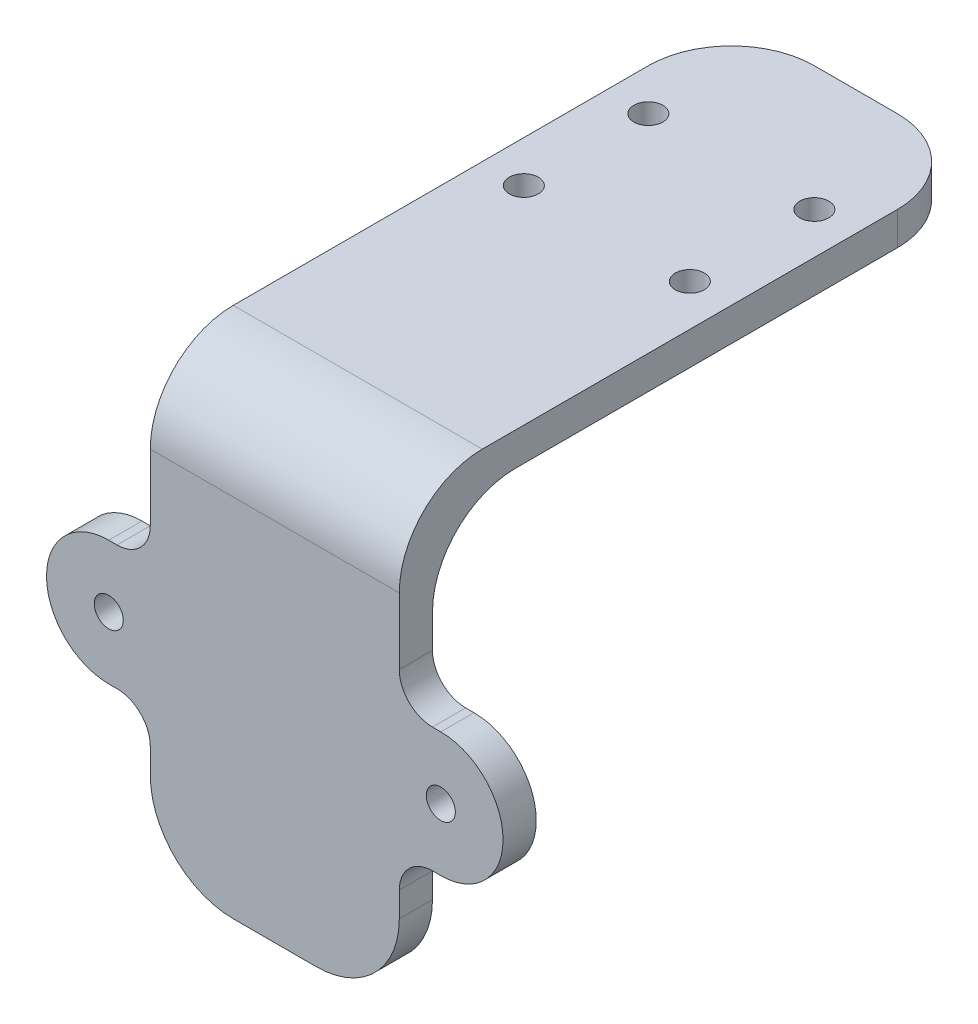
ISO-10303-21;
HEADER;
FILE_DESCRIPTION(('STEP AP214'),'2;1');
FILE_NAME('part.step','',(''),(''),'','','');
FILE_SCHEMA(('AUTOMOTIVE_DESIGN { 1 0 10303 214 1 1 1 1 }'));
ENDSEC;
DATA;
#1=APPLICATION_CONTEXT('core data for automotive mechanical design processes');
#2=APPLICATION_PROTOCOL_DEFINITION('international standard','automotive_design',2000,#1);
#3=PRODUCT_CONTEXT('',#1,'mechanical');
#4=PRODUCT('Part','Part','',(#3));
#5=PRODUCT_RELATED_PRODUCT_CATEGORY('part','',(#4));
#6=PRODUCT_DEFINITION_FORMATION('','',#4);
#7=PRODUCT_DEFINITION_CONTEXT('part definition',#1,'design');
#8=PRODUCT_DEFINITION('design','',#6,#7);
#9=PRODUCT_DEFINITION_SHAPE('','',#8);
#10=(LENGTH_UNIT() NAMED_UNIT(*) SI_UNIT(.MILLI.,.METRE.));
#11=(NAMED_UNIT(*) PLANE_ANGLE_UNIT() SI_UNIT($,.RADIAN.));
#12=(NAMED_UNIT(*) SI_UNIT($,.STERADIAN.) SOLID_ANGLE_UNIT());
#13=UNCERTAINTY_MEASURE_WITH_UNIT(LENGTH_MEASURE(1.E-05),#10,'distance_accuracy_value','');
#14=(GEOMETRIC_REPRESENTATION_CONTEXT(3) GLOBAL_UNCERTAINTY_ASSIGNED_CONTEXT((#13)) GLOBAL_UNIT_ASSIGNED_CONTEXT((#10,
#11,#12)) REPRESENTATION_CONTEXT('',''));
#15=CARTESIAN_POINT('',(0.,0.,0.));
#16=DIRECTION('',(0.,0.,1.));
#17=DIRECTION('',(1.,0.,0.));
#18=AXIS2_PLACEMENT_3D('',#15,#16,#17);
#19=CARTESIAN_POINT('',(10.,-6.94974746830583,-5.));
#20=DIRECTION('',(0.,1.,0.));
#21=DIRECTION('',(0.,0.,1.));
#22=AXIS2_PLACEMENT_3D('',#19,#20,#21);
#23=CYLINDRICAL_SURFACE('',#22,1.75);
#24=CARTESIAN_POINT('',(10.,2.,-5.));
#25=DIRECTION('',(0.,1.,0.));
#26=DIRECTION('',(0.,0.,1.));
#27=AXIS2_PLACEMENT_3D('',#24,#25,#26);
#28=CIRCLE('',#27,1.75);
#29=CARTESIAN_POINT('',(10.,2.,-3.25));
#30=VERTEX_POINT('',#29);
#31=EDGE_CURVE('E315',#30,#30,#28,.T.);
#32=ORIENTED_EDGE('',*,*,#31,.T.);
#33=EDGE_LOOP('',(#32));
#34=FACE_BOUND('',#33,.T.);
#35=CARTESIAN_POINT('',(10.,-2.,-5.));
#36=DIRECTION('',(0.,-1.,0.));
#37=DIRECTION('',(0.,0.,-1.));
#38=AXIS2_PLACEMENT_3D('',#35,#36,#37);
#39=CIRCLE('',#38,1.75);
#40=CARTESIAN_POINT('',(10.,-2.,-6.75000000000001));
#41=VERTEX_POINT('',#40);
#42=EDGE_CURVE('E319',#41,#41,#39,.F.);
#43=ORIENTED_EDGE('',*,*,#42,.F.);
#44=EDGE_LOOP('',(#43));
#45=FACE_BOUND('',#44,.T.);
#46=ADVANCED_FACE('F39',(#34,#45),#23,.F.);
#47=CARTESIAN_POINT('',(10.,-6.94974746830583,-20.));
#48=DIRECTION('',(0.,1.,0.));
#49=DIRECTION('',(0.,0.,1.));
#50=AXIS2_PLACEMENT_3D('',#47,#48,#49);
#51=CYLINDRICAL_SURFACE('',#50,1.75);
#52=CARTESIAN_POINT('',(10.,2.,-20.));
#53=DIRECTION('',(0.,1.,0.));
#54=DIRECTION('',(0.,0.,1.));
#55=AXIS2_PLACEMENT_3D('',#52,#53,#54);
#56=CIRCLE('',#55,1.75);
#57=CARTESIAN_POINT('',(10.,2.,-18.25));
#58=VERTEX_POINT('',#57);
#59=EDGE_CURVE('E307',#58,#58,#56,.T.);
#60=ORIENTED_EDGE('',*,*,#59,.T.);
#61=EDGE_LOOP('',(#60));
#62=FACE_BOUND('',#61,.T.);
#63=CARTESIAN_POINT('',(10.,-2.,-20.));
#64=DIRECTION('',(0.,-1.,0.));
#65=DIRECTION('',(0.,0.,-1.));
#66=AXIS2_PLACEMENT_3D('',#63,#64,#65);
#67=CIRCLE('',#66,1.75);
#68=CARTESIAN_POINT('',(10.,-2.,-21.75));
#69=VERTEX_POINT('',#68);
#70=EDGE_CURVE('E311',#69,#69,#67,.F.);
#71=ORIENTED_EDGE('',*,*,#70,.F.);
#72=EDGE_LOOP('',(#71));
#73=FACE_BOUND('',#72,.T.);
#74=ADVANCED_FACE('F517',(#62,#73),#51,.F.);
#75=CARTESIAN_POINT('',(15.,2.,35.));
#76=DIRECTION('',(-1.,0.,0.));
#77=DIRECTION('',(0.,0.,1.));
#78=AXIS2_PLACEMENT_3D('',#75,#76,#77);
#79=PLANE('',#78);
#80=DIRECTION('',(0.,1.,0.));
#81=VECTOR('',#80,1.);
#82=CARTESIAN_POINT('',(15.,-52.,31.));
#83=LINE('',#82,#81);
#84=CARTESIAN_POINT('',(15.,-42.,31.));
#85=VERTEX_POINT('',#84);
#86=CARTESIAN_POINT('',(15.,-39.,31.));
#87=VERTEX_POINT('',#86);
#88=EDGE_CURVE('E265',#85,#87,#83,.T.);
#89=ORIENTED_EDGE('',*,*,#88,.T.);
#90=DIRECTION('',(0.,0.,1.));
#91=VECTOR('',#90,1.);
#92=CARTESIAN_POINT('',(15.,-39.,35.));
#93=LINE('',#92,#91);
#94=CARTESIAN_POINT('',(15.,-39.,35.));
#95=VERTEX_POINT('',#94);
#96=EDGE_CURVE('E404',#87,#95,#93,.T.);
#97=ORIENTED_EDGE('',*,*,#96,.T.);
#98=DIRECTION('',(0.,-1.,0.));
#99=VECTOR('',#98,1.);
#100=CARTESIAN_POINT('',(15.,2.,35.));
#101=LINE('',#100,#99);
#102=CARTESIAN_POINT('',(15.,-42.,35.));
#103=VERTEX_POINT('',#102);
#104=EDGE_CURVE('E287',#95,#103,#101,.T.);
#105=ORIENTED_EDGE('',*,*,#104,.T.);
#106=DIRECTION('',(0.,0.,1.));
#107=VECTOR('',#106,1.);
#108=CARTESIAN_POINT('',(15.,-42.,35.));
#109=LINE('',#108,#107);
#110=EDGE_CURVE('E394',#103,#85,#109,.F.);
#111=ORIENTED_EDGE('',*,*,#110,.T.);
#112=EDGE_LOOP('',(#89,#97,#105,#111));
#113=FACE_BOUND('',#112,.T.);
#114=ADVANCED_FACE('F546',(#113),#79,.F.);
#115=CARTESIAN_POINT('',(-15.,2.,35.));
#116=DIRECTION('',(1.,0.,0.));
#117=DIRECTION('',(0.,0.,-1.));
#118=AXIS2_PLACEMENT_3D('',#115,#116,#117);
#119=PLANE('',#118);
#120=DIRECTION('',(0.,-1.,0.));
#121=VECTOR('',#120,1.);
#122=CARTESIAN_POINT('',(-15.,2.,35.));
#123=LINE('',#122,#121);
#124=CARTESIAN_POINT('',(-15.,-39.,35.));
#125=VERTEX_POINT('',#124);
#126=CARTESIAN_POINT('',(-15.,-42.,35.));
#127=VERTEX_POINT('',#126);
#128=EDGE_CURVE('E302',#125,#127,#123,.T.);
#129=ORIENTED_EDGE('',*,*,#128,.F.);
#130=DIRECTION('',(0.,0.,-1.));
#131=VECTOR('',#130,1.);
#132=CARTESIAN_POINT('',(-15.,-39.,35.));
#133=LINE('',#132,#131);
#134=CARTESIAN_POINT('',(-15.,-39.,31.));
#135=VERTEX_POINT('',#134);
#136=EDGE_CURVE('E425',#125,#135,#133,.T.);
#137=ORIENTED_EDGE('',*,*,#136,.T.);
#138=DIRECTION('',(0.,1.,0.));
#139=VECTOR('',#138,1.);
#140=CARTESIAN_POINT('',(-15.,-52.,31.));
#141=LINE('',#140,#139);
#142=CARTESIAN_POINT('',(-15.,-42.,31.));
#143=VERTEX_POINT('',#142);
#144=EDGE_CURVE('E270',#143,#135,#141,.T.);
#145=ORIENTED_EDGE('',*,*,#144,.F.);
#146=DIRECTION('',(0.,0.,-1.));
#147=VECTOR('',#146,1.);
#148=CARTESIAN_POINT('',(-15.,-42.,35.));
#149=LINE('',#148,#147);
#150=EDGE_CURVE('E380',#143,#127,#149,.F.);
#151=ORIENTED_EDGE('',*,*,#150,.T.);
#152=EDGE_LOOP('',(#129,#137,#145,#151));
#153=FACE_BOUND('',#152,.T.);
#154=ADVANCED_FACE('F538',(#153),#119,.F.);
#155=CARTESIAN_POINT('',(15.,-8.,35.));
#156=VERTEX_POINT('',#155);
#157=CARTESIAN_POINT('',(15.,-16.,35.));
#158=VERTEX_POINT('',#157);
#159=EDGE_CURVE('E298',#156,#158,#101,.T.);
#160=ORIENTED_EDGE('',*,*,#159,.T.);
#161=DIRECTION('',(0.,0.,-1.));
#162=VECTOR('',#161,1.);
#163=CARTESIAN_POINT('',(15.,-16.,35.));
#164=LINE('',#163,#162);
#165=CARTESIAN_POINT('',(15.,-16.,31.));
#166=VERTEX_POINT('',#165);
#167=EDGE_CURVE('E411',#158,#166,#164,.T.);
#168=ORIENTED_EDGE('',*,*,#167,.T.);
#169=CARTESIAN_POINT('',(15.,-12.,31.));
#170=VERTEX_POINT('',#169);
#171=EDGE_CURVE('E264',#166,#170,#83,.T.);
#172=ORIENTED_EDGE('',*,*,#171,.T.);
#173=CARTESIAN_POINT('',(15.,-12.,21.));
#174=DIRECTION('',(-1.,0.,0.));
#175=DIRECTION('',(0.,0.,1.));
#176=AXIS2_PLACEMENT_3D('',#173,#174,#175);
#177=CIRCLE('',#176,10.);
#178=CARTESIAN_POINT('',(15.,-2.,21.));
#179=VERTEX_POINT('',#178);
#180=EDGE_CURVE('E397',#170,#179,#177,.T.);
#181=ORIENTED_EDGE('',*,*,#180,.T.);
#182=DIRECTION('',(0.,0.,-1.));
#183=VECTOR('',#182,1.);
#184=CARTESIAN_POINT('',(15.,-2.,35.));
#185=LINE('',#184,#183);
#186=CARTESIAN_POINT('',(15.,-2.,-25.));
#187=VERTEX_POINT('',#186);
#188=EDGE_CURVE('E273',#179,#187,#185,.T.);
#189=ORIENTED_EDGE('',*,*,#188,.T.);
#190=DIRECTION('',(0.,-1.,0.));
#191=VECTOR('',#190,1.);
#192=CARTESIAN_POINT('',(15.,2.,-25.));
#193=LINE('',#192,#191);
#194=CARTESIAN_POINT('',(15.,2.,-25.));
#195=VERTEX_POINT('',#194);
#196=EDGE_CURVE('E342',#187,#195,#193,.F.);
#197=ORIENTED_EDGE('',*,*,#196,.T.);
#198=DIRECTION('',(0.,0.,-1.));
#199=VECTOR('',#198,1.);
#200=CARTESIAN_POINT('',(15.,2.,35.));
#201=LINE('',#200,#199);
#202=CARTESIAN_POINT('',(15.,2.,25.));
#203=VERTEX_POINT('',#202);
#204=EDGE_CURVE('E274',#203,#195,#201,.T.);
#205=ORIENTED_EDGE('',*,*,#204,.F.);
#206=CARTESIAN_POINT('',(15.,-8.,25.));
#207=DIRECTION('',(-1.,0.,0.));
#208=DIRECTION('',(0.,0.,1.));
#209=AXIS2_PLACEMENT_3D('',#206,#207,#208);
#210=CIRCLE('',#209,10.);
#211=EDGE_CURVE('E339',#203,#156,#210,.F.);
#212=ORIENTED_EDGE('',*,*,#211,.T.);
#213=EDGE_LOOP('',(#160,#168,#172,#181,#189,#197,#205,#212));
#214=FACE_BOUND('',#213,.T.);
#215=ADVANCED_FACE('F541',(#214),#79,.F.);
#216=CARTESIAN_POINT('',(-15.,2.,-35.));
#217=DIRECTION('',(0.,0.,1.));
#218=DIRECTION('',(1.,0.,0.));
#219=AXIS2_PLACEMENT_3D('',#216,#217,#218);
#220=PLANE('',#219);
#221=DIRECTION('',(-1.,0.,0.));
#222=VECTOR('',#221,1.);
#223=CARTESIAN_POINT('',(-15.,2.,-35.));
#224=LINE('',#223,#222);
#225=CARTESIAN_POINT('',(5.,2.,-35.));
#226=VERTEX_POINT('',#225);
#227=CARTESIAN_POINT('',(-5.,2.,-35.));
#228=VERTEX_POINT('',#227);
#229=EDGE_CURVE('E278',#226,#228,#224,.T.);
#230=ORIENTED_EDGE('',*,*,#229,.F.);
#231=DIRECTION('',(0.,-1.,0.));
#232=VECTOR('',#231,1.);
#233=CARTESIAN_POINT('',(5.,2.,-35.));
#234=LINE('',#233,#232);
#235=CARTESIAN_POINT('',(5.,-2.,-35.));
#236=VERTEX_POINT('',#235);
#237=EDGE_CURVE('E326',#226,#236,#234,.T.);
#238=ORIENTED_EDGE('',*,*,#237,.T.);
#239=DIRECTION('',(-1.,0.,0.));
#240=VECTOR('',#239,1.);
#241=CARTESIAN_POINT('',(-15.,-2.,-35.));
#242=LINE('',#241,#240);
#243=CARTESIAN_POINT('',(-5.,-2.,-35.));
#244=VERTEX_POINT('',#243);
#245=EDGE_CURVE('E291',#236,#244,#242,.T.);
#246=ORIENTED_EDGE('',*,*,#245,.T.);
#247=DIRECTION('',(0.,-1.,0.));
#248=VECTOR('',#247,1.);
#249=CARTESIAN_POINT('',(-5.,2.,-35.));
#250=LINE('',#249,#248);
#251=EDGE_CURVE('E323',#244,#228,#250,.F.);
#252=ORIENTED_EDGE('',*,*,#251,.T.);
#253=EDGE_LOOP('',(#230,#238,#246,#252));
#254=FACE_BOUND('',#253,.T.);
#255=ADVANCED_FACE('F536',(#254),#220,.F.);
#256=CARTESIAN_POINT('',(-15.,-16.,31.));
#257=VERTEX_POINT('',#256);
#258=CARTESIAN_POINT('',(-15.,-12.,31.));
#259=VERTEX_POINT('',#258);
#260=EDGE_CURVE('E269',#257,#259,#141,.T.);
#261=ORIENTED_EDGE('',*,*,#260,.F.);
#262=DIRECTION('',(0.,0.,1.));
#263=VECTOR('',#262,1.);
#264=CARTESIAN_POINT('',(-15.,-16.,35.));
#265=LINE('',#264,#263);
#266=CARTESIAN_POINT('',(-15.,-16.,35.));
#267=VERTEX_POINT('',#266);
#268=EDGE_CURVE('E418',#257,#267,#265,.T.);
#269=ORIENTED_EDGE('',*,*,#268,.T.);
#270=CARTESIAN_POINT('',(-15.,-8.,35.));
#271=VERTEX_POINT('',#270);
#272=EDGE_CURVE('E303',#271,#267,#123,.T.);
#273=ORIENTED_EDGE('',*,*,#272,.F.);
#274=CARTESIAN_POINT('',(-15.,-8.,25.));
#275=DIRECTION('',(1.,0.,0.));
#276=DIRECTION('',(0.,0.,-1.));
#277=AXIS2_PLACEMENT_3D('',#274,#275,#276);
#278=CIRCLE('',#277,10.);
#279=CARTESIAN_POINT('',(-15.,2.,25.));
#280=VERTEX_POINT('',#279);
#281=EDGE_CURVE('E355',#271,#280,#278,.F.);
#282=ORIENTED_EDGE('',*,*,#281,.T.);
#283=DIRECTION('',(0.,0.,1.));
#284=VECTOR('',#283,1.);
#285=CARTESIAN_POINT('',(-15.,2.,35.));
#286=LINE('',#285,#284);
#287=CARTESIAN_POINT('',(-15.,2.,-25.));
#288=VERTEX_POINT('',#287);
#289=EDGE_CURVE('E283',#288,#280,#286,.T.);
#290=ORIENTED_EDGE('',*,*,#289,.F.);
#291=DIRECTION('',(0.,-1.,0.));
#292=VECTOR('',#291,1.);
#293=CARTESIAN_POINT('',(-15.,2.,-25.));
#294=LINE('',#293,#292);
#295=CARTESIAN_POINT('',(-15.,-2.,-25.));
#296=VERTEX_POINT('',#295);
#297=EDGE_CURVE('E358',#288,#296,#294,.T.);
#298=ORIENTED_EDGE('',*,*,#297,.T.);
#299=DIRECTION('',(0.,0.,1.));
#300=VECTOR('',#299,1.);
#301=CARTESIAN_POINT('',(-15.,-2.,35.));
#302=LINE('',#301,#300);
#303=CARTESIAN_POINT('',(-15.,-2.,21.));
#304=VERTEX_POINT('',#303);
#305=EDGE_CURVE('E279',#296,#304,#302,.T.);
#306=ORIENTED_EDGE('',*,*,#305,.T.);
#307=CARTESIAN_POINT('',(-15.,-12.,21.));
#308=DIRECTION('',(1.,0.,0.));
#309=DIRECTION('',(0.,0.,-1.));
#310=AXIS2_PLACEMENT_3D('',#307,#308,#309);
#311=CIRCLE('',#310,10.);
#312=EDGE_CURVE('E400',#304,#259,#311,.T.);
#313=ORIENTED_EDGE('',*,*,#312,.T.);
#314=EDGE_LOOP('',(#261,#269,#273,#282,#290,#298,#306,#313));
#315=FACE_BOUND('',#314,.T.);
#316=ADVANCED_FACE('F533',(#315),#119,.F.);
#317=CARTESIAN_POINT('',(-15.,2.,35.));
#318=DIRECTION('',(0.,0.,-1.));
#319=DIRECTION('',(-1.,0.,0.));
#320=AXIS2_PLACEMENT_3D('',#317,#318,#319);
#321=PLANE('',#320);
#322=DIRECTION('',(1.,0.,0.));
#323=VECTOR('',#322,1.);
#324=CARTESIAN_POINT('',(20.,-35.,35.));
#325=LINE('',#324,#323);
#326=CARTESIAN_POINT('',(-20.,-35.,35.));
#327=VERTEX_POINT('',#326);
#328=CARTESIAN_POINT('',(-19.,-35.,35.));
#329=VERTEX_POINT('',#328);
#330=EDGE_CURVE('E211',#327,#329,#325,.T.);
#331=ORIENTED_EDGE('',*,*,#330,.T.);
#332=CARTESIAN_POINT('',(-19.,-39.,35.));
#333=DIRECTION('',(0.,0.,-1.));
#334=DIRECTION('',(-1.,0.,0.));
#335=AXIS2_PLACEMENT_3D('',#332,#333,#334);
#336=CIRCLE('',#335,4.);
#337=EDGE_CURVE('E11',#329,#125,#336,.T.);
#338=ORIENTED_EDGE('',*,*,#337,.T.);
#339=ORIENTED_EDGE('',*,*,#128,.T.);
#340=CARTESIAN_POINT('',(-5.,-42.,35.));
#341=DIRECTION('',(0.,0.,-1.));
#342=DIRECTION('',(-1.,0.,0.));
#343=AXIS2_PLACEMENT_3D('',#340,#341,#342);
#344=CIRCLE('',#343,10.);
#345=CARTESIAN_POINT('',(-4.99999999999999,-52.,35.));
#346=VERTEX_POINT('',#345);
#347=EDGE_CURVE('E391',#127,#346,#344,.F.);
#348=ORIENTED_EDGE('',*,*,#347,.T.);
#349=DIRECTION('',(-1.,0.,0.));
#350=VECTOR('',#349,1.);
#351=CARTESIAN_POINT('',(15.,-52.,35.));
#352=LINE('',#351,#350);
#353=CARTESIAN_POINT('',(5.,-52.,35.));
#354=VERTEX_POINT('',#353);
#355=EDGE_CURVE('E256',#354,#346,#352,.T.);
#356=ORIENTED_EDGE('',*,*,#355,.F.);
#357=CARTESIAN_POINT('',(5.,-42.,35.));
#358=DIRECTION('',(0.,0.,-1.));
#359=DIRECTION('',(-1.,0.,0.));
#360=AXIS2_PLACEMENT_3D('',#357,#358,#359);
#361=CIRCLE('',#360,10.);
#362=EDGE_CURVE('E387',#354,#103,#361,.F.);
#363=ORIENTED_EDGE('',*,*,#362,.T.);
#364=ORIENTED_EDGE('',*,*,#104,.F.);
#365=CARTESIAN_POINT('',(19.,-39.,35.));
#366=DIRECTION('',(0.,0.,-1.));
#367=DIRECTION('',(-1.,0.,0.));
#368=AXIS2_PLACEMENT_3D('',#365,#366,#367);
#369=CIRCLE('',#368,4.);
#370=CARTESIAN_POINT('',(19.,-35.,35.));
#371=VERTEX_POINT('',#370);
#372=EDGE_CURVE('E431',#95,#371,#369,.T.);
#373=ORIENTED_EDGE('',*,*,#372,.T.);
#374=CARTESIAN_POINT('',(20.,-35.,35.));
#375=VERTEX_POINT('',#374);
#376=EDGE_CURVE('E217',#371,#375,#325,.T.);
#377=ORIENTED_EDGE('',*,*,#376,.T.);
#378=CARTESIAN_POINT('',(20.,-27.5,35.));
#379=DIRECTION('',(0.,0.,1.));
#380=DIRECTION('',(1.,0.,0.));
#381=AXIS2_PLACEMENT_3D('',#378,#379,#380);
#382=CIRCLE('',#381,7.50000000000001);
#383=CARTESIAN_POINT('',(20.,-20.,35.));
#384=VERTEX_POINT('',#383);
#385=EDGE_CURVE('E216',#375,#384,#382,.T.);
#386=ORIENTED_EDGE('',*,*,#385,.T.);
#387=DIRECTION('',(-1.,0.,0.));
#388=VECTOR('',#387,1.);
#389=CARTESIAN_POINT('',(20.,-20.,35.));
#390=LINE('',#389,#388);
#391=CARTESIAN_POINT('',(19.,-20.,35.));
#392=VERTEX_POINT('',#391);
#393=EDGE_CURVE('E209',#384,#392,#390,.T.);
#394=ORIENTED_EDGE('',*,*,#393,.T.);
#395=CARTESIAN_POINT('',(19.,-16.,35.));
#396=DIRECTION('',(0.,0.,-1.));
#397=DIRECTION('',(-1.,0.,0.));
#398=AXIS2_PLACEMENT_3D('',#395,#396,#397);
#399=CIRCLE('',#398,4.);
#400=EDGE_CURVE('E440',#392,#158,#399,.T.);
#401=ORIENTED_EDGE('',*,*,#400,.T.);
#402=ORIENTED_EDGE('',*,*,#159,.F.);
#403=DIRECTION('',(1.,0.,0.));
#404=VECTOR('',#403,1.);
#405=CARTESIAN_POINT('',(-15.,-8.,35.));
#406=LINE('',#405,#404);
#407=EDGE_CURVE('E384',#156,#271,#406,.F.);
#408=ORIENTED_EDGE('',*,*,#407,.T.);
#409=ORIENTED_EDGE('',*,*,#272,.T.);
#410=CARTESIAN_POINT('',(-19.,-16.,35.));
#411=DIRECTION('',(0.,0.,-1.));
#412=DIRECTION('',(-1.,0.,0.));
#413=AXIS2_PLACEMENT_3D('',#410,#411,#412);
#414=CIRCLE('',#413,4.);
#415=CARTESIAN_POINT('',(-19.,-20.,35.));
#416=VERTEX_POINT('',#415);
#417=EDGE_CURVE('E443',#267,#416,#414,.T.);
#418=ORIENTED_EDGE('',*,*,#417,.T.);
#419=CARTESIAN_POINT('',(-20.,-20.,35.));
#420=VERTEX_POINT('',#419);
#421=EDGE_CURVE('E222',#416,#420,#390,.T.);
#422=ORIENTED_EDGE('',*,*,#421,.T.);
#423=CARTESIAN_POINT('',(-20.,-27.5,35.));
#424=DIRECTION('',(0.,0.,1.));
#425=DIRECTION('',(-1.,0.,0.));
#426=AXIS2_PLACEMENT_3D('',#423,#424,#425);
#427=CIRCLE('',#426,7.50000000000001);
#428=EDGE_CURVE('E205',#420,#327,#427,.T.);
#429=ORIENTED_EDGE('',*,*,#428,.T.);
#430=EDGE_LOOP('',(#331,#338,#339,#348,#356,#363,#364,#373,#377,#386,#394,#401,#402,#408,#409,
#418,#422,#429));
#431=FACE_BOUND('',#430,.T.);
#432=CARTESIAN_POINT('',(-20.,-27.5,35.));
#433=DIRECTION('',(0.,0.,1.));
#434=DIRECTION('',(1.,0.,0.));
#435=AXIS2_PLACEMENT_3D('',#432,#433,#434);
#436=CIRCLE('',#435,1.75);
#437=CARTESIAN_POINT('',(-18.25,-27.5,35.));
#438=VERTEX_POINT('',#437);
#439=EDGE_CURVE('E225',#438,#438,#436,.T.);
#440=ORIENTED_EDGE('',*,*,#439,.F.);
#441=EDGE_LOOP('',(#440));
#442=FACE_BOUND('',#441,.T.);
#443=CARTESIAN_POINT('',(20.,-27.5,35.));
#444=DIRECTION('',(0.,0.,1.));
#445=DIRECTION('',(-1.,0.,0.));
#446=AXIS2_PLACEMENT_3D('',#443,#444,#445);
#447=CIRCLE('',#446,1.75);
#448=CARTESIAN_POINT('',(18.25,-27.5,35.));
#449=VERTEX_POINT('',#448);
#450=EDGE_CURVE('E230',#449,#449,#447,.T.);
#451=ORIENTED_EDGE('',*,*,#450,.F.);
#452=EDGE_LOOP('',(#451));
#453=FACE_BOUND('',#452,.T.);
#454=ADVANCED_FACE('F219',(#431,#442,#453),#321,.F.);
#455=CARTESIAN_POINT('',(0.,2.,0.));
#456=DIRECTION('',(0.,-1.,0.));
#457=DIRECTION('',(0.,0.,-1.));
#458=AXIS2_PLACEMENT_3D('',#455,#456,#457);
#459=PLANE('',#458);
#460=CARTESIAN_POINT('',(-10.,2.,-5.));
#461=DIRECTION('',(0.,1.,0.));
#462=DIRECTION('',(0.,0.,1.));
#463=AXIS2_PLACEMENT_3D('',#460,#461,#462);
#464=CIRCLE('',#463,1.75);
#465=CARTESIAN_POINT('',(-10.,2.,-3.25));
#466=VERTEX_POINT('',#465);
#467=EDGE_CURVE('E493',#466,#466,#464,.T.);
#468=ORIENTED_EDGE('',*,*,#467,.F.);
#469=EDGE_LOOP('',(#468));
#470=FACE_BOUND('',#469,.T.);
#471=CARTESIAN_POINT('',(-10.,2.,-20.));
#472=DIRECTION('',(0.,1.,0.));
#473=DIRECTION('',(0.,0.,1.));
#474=AXIS2_PLACEMENT_3D('',#471,#472,#473);
#475=CIRCLE('',#474,1.75);
#476=CARTESIAN_POINT('',(-10.,2.,-18.25));
#477=VERTEX_POINT('',#476);
#478=EDGE_CURVE('E481',#477,#477,#475,.T.);
#479=ORIENTED_EDGE('',*,*,#478,.F.);
#480=EDGE_LOOP('',(#479));
#481=FACE_BOUND('',#480,.T.);
#482=ORIENTED_EDGE('',*,*,#204,.T.);
#483=CARTESIAN_POINT('',(5.,2.,-25.));
#484=DIRECTION('',(0.,-1.,0.));
#485=DIRECTION('',(0.,0.,-1.));
#486=AXIS2_PLACEMENT_3D('',#483,#484,#485);
#487=CIRCLE('',#486,10.);
#488=EDGE_CURVE('E352',#195,#226,#487,.F.);
#489=ORIENTED_EDGE('',*,*,#488,.T.);
#490=ORIENTED_EDGE('',*,*,#229,.T.);
#491=CARTESIAN_POINT('',(-5.,2.,-25.));
#492=DIRECTION('',(0.,-1.,0.));
#493=DIRECTION('',(0.,0.,-1.));
#494=AXIS2_PLACEMENT_3D('',#491,#492,#493);
#495=CIRCLE('',#494,10.);
#496=EDGE_CURVE('E349',#228,#288,#495,.F.);
#497=ORIENTED_EDGE('',*,*,#496,.T.);
#498=ORIENTED_EDGE('',*,*,#289,.T.);
#499=DIRECTION('',(1.,0.,0.));
#500=VECTOR('',#499,1.);
#501=CARTESIAN_POINT('',(0.,2.,25.));
#502=LINE('',#501,#500);
#503=EDGE_CURVE('E345',#280,#203,#502,.T.);
#504=ORIENTED_EDGE('',*,*,#503,.T.);
#505=EDGE_LOOP('',(#482,#489,#490,#497,#498,#504));
#506=FACE_BOUND('',#505,.T.);
#507=ORIENTED_EDGE('',*,*,#59,.F.);
#508=EDGE_LOOP('',(#507));
#509=FACE_BOUND('',#508,.T.);
#510=ORIENTED_EDGE('',*,*,#31,.F.);
#511=EDGE_LOOP('',(#510));
#512=FACE_BOUND('',#511,.T.);
#513=ADVANCED_FACE('F501',(#470,#481,#506,#509,#512),#459,.F.);
#514=CARTESIAN_POINT('',(0.,-2.,0.));
#515=DIRECTION('',(0.,-1.,0.));
#516=DIRECTION('',(0.,0.,-1.));
#517=AXIS2_PLACEMENT_3D('',#514,#515,#516);
#518=PLANE('',#517);
#519=CARTESIAN_POINT('',(-10.,-2.,-5.));
#520=DIRECTION('',(0.,-1.,0.));
#521=DIRECTION('',(0.,0.,-1.));
#522=AXIS2_PLACEMENT_3D('',#519,#520,#521);
#523=CIRCLE('',#522,1.75);
#524=CARTESIAN_POINT('',(-10.,-2.,-6.75000000000001));
#525=VERTEX_POINT('',#524);
#526=EDGE_CURVE('E487',#525,#525,#523,.F.);
#527=ORIENTED_EDGE('',*,*,#526,.T.);
#528=EDGE_LOOP('',(#527));
#529=FACE_BOUND('',#528,.T.);
#530=CARTESIAN_POINT('',(-10.,-2.,-20.));
#531=DIRECTION('',(0.,-1.,0.));
#532=DIRECTION('',(0.,0.,-1.));
#533=AXIS2_PLACEMENT_3D('',#530,#531,#532);
#534=CIRCLE('',#533,1.75);
#535=CARTESIAN_POINT('',(-10.,-2.,-21.75));
#536=VERTEX_POINT('',#535);
#537=EDGE_CURVE('E476',#536,#536,#534,.F.);
#538=ORIENTED_EDGE('',*,*,#537,.T.);
#539=EDGE_LOOP('',(#538));
#540=FACE_BOUND('',#539,.T.);
#541=ORIENTED_EDGE('',*,*,#245,.F.);
#542=CARTESIAN_POINT('',(5.,-2.,-25.));
#543=DIRECTION('',(0.,-1.,0.));
#544=DIRECTION('',(0.,0.,-1.));
#545=AXIS2_PLACEMENT_3D('',#542,#543,#544);
#546=CIRCLE('',#545,10.);
#547=EDGE_CURVE('E336',#236,#187,#546,.T.);
#548=ORIENTED_EDGE('',*,*,#547,.T.);
#549=ORIENTED_EDGE('',*,*,#188,.F.);
#550=DIRECTION('',(1.,0.,0.));
#551=VECTOR('',#550,1.);
#552=CARTESIAN_POINT('',(0.,-2.,21.));
#553=LINE('',#552,#551);
#554=EDGE_CURVE('E330',#179,#304,#553,.F.);
#555=ORIENTED_EDGE('',*,*,#554,.T.);
#556=ORIENTED_EDGE('',*,*,#305,.F.);
#557=CARTESIAN_POINT('',(-5.,-2.,-25.));
#558=DIRECTION('',(0.,-1.,0.));
#559=DIRECTION('',(0.,0.,-1.));
#560=AXIS2_PLACEMENT_3D('',#557,#558,#559);
#561=CIRCLE('',#560,10.);
#562=EDGE_CURVE('E333',#296,#244,#561,.T.);
#563=ORIENTED_EDGE('',*,*,#562,.T.);
#564=EDGE_LOOP('',(#541,#548,#549,#555,#556,#563));
#565=FACE_BOUND('',#564,.T.);
#566=ORIENTED_EDGE('',*,*,#70,.T.);
#567=EDGE_LOOP('',(#566));
#568=FACE_BOUND('',#567,.T.);
#569=ORIENTED_EDGE('',*,*,#42,.T.);
#570=EDGE_LOOP('',(#569));
#571=FACE_BOUND('',#570,.T.);
#572=ADVANCED_FACE('F504',(#529,#540,#565,#568,#571),#518,.T.);
#573=CARTESIAN_POINT('',(15.,-52.,31.));
#574=DIRECTION('',(0.,0.,1.));
#575=DIRECTION('',(1.,0.,0.));
#576=AXIS2_PLACEMENT_3D('',#573,#574,#575);
#577=PLANE('',#576);
#578=DIRECTION('',(1.,0.,0.));
#579=VECTOR('',#578,1.);
#580=CARTESIAN_POINT('',(15.,-52.,31.));
#581=LINE('',#580,#579);
#582=CARTESIAN_POINT('',(-4.99999999999999,-52.,31.));
#583=VERTEX_POINT('',#582);
#584=CARTESIAN_POINT('',(5.,-52.,31.));
#585=VERTEX_POINT('',#584);
#586=EDGE_CURVE('E260',#583,#585,#581,.T.);
#587=ORIENTED_EDGE('',*,*,#586,.F.);
#588=CARTESIAN_POINT('',(-5.,-42.,31.));
#589=DIRECTION('',(0.,0.,1.));
#590=DIRECTION('',(1.,0.,0.));
#591=AXIS2_PLACEMENT_3D('',#588,#589,#590);
#592=CIRCLE('',#591,10.);
#593=EDGE_CURVE('E377',#583,#143,#592,.F.);
#594=ORIENTED_EDGE('',*,*,#593,.T.);
#595=ORIENTED_EDGE('',*,*,#144,.T.);
#596=CARTESIAN_POINT('',(-19.,-39.,31.));
#597=DIRECTION('',(0.,0.,1.));
#598=DIRECTION('',(1.,0.,0.));
#599=AXIS2_PLACEMENT_3D('',#596,#597,#598);
#600=CIRCLE('',#599,4.);
#601=CARTESIAN_POINT('',(-19.,-35.,31.));
#602=VERTEX_POINT('',#601);
#603=EDGE_CURVE('E48',#135,#602,#600,.T.);
#604=ORIENTED_EDGE('',*,*,#603,.T.);
#605=DIRECTION('',(-1.,0.,0.));
#606=VECTOR('',#605,1.);
#607=CARTESIAN_POINT('',(20.,-35.,31.));
#608=LINE('',#607,#606);
#609=CARTESIAN_POINT('',(-20.,-35.,31.));
#610=VERTEX_POINT('',#609);
#611=EDGE_CURVE('E459',#602,#610,#608,.T.);
#612=ORIENTED_EDGE('',*,*,#611,.T.);
#613=CARTESIAN_POINT('',(-20.,-27.5,31.));
#614=DIRECTION('',(0.,0.,1.));
#615=DIRECTION('',(1.,0.,0.));
#616=AXIS2_PLACEMENT_3D('',#613,#614,#615);
#617=CIRCLE('',#616,7.50000000000001);
#618=CARTESIAN_POINT('',(-20.,-20.,31.));
#619=VERTEX_POINT('',#618);
#620=EDGE_CURVE('E206',#610,#619,#617,.F.);
#621=ORIENTED_EDGE('',*,*,#620,.T.);
#622=DIRECTION('',(1.,0.,0.));
#623=VECTOR('',#622,1.);
#624=CARTESIAN_POINT('',(20.,-20.,31.));
#625=LINE('',#624,#623);
#626=CARTESIAN_POINT('',(-19.,-20.,31.));
#627=VERTEX_POINT('',#626);
#628=EDGE_CURVE('E463',#619,#627,#625,.T.);
#629=ORIENTED_EDGE('',*,*,#628,.T.);
#630=CARTESIAN_POINT('',(-19.,-16.,31.));
#631=DIRECTION('',(0.,0.,1.));
#632=DIRECTION('',(1.,0.,0.));
#633=AXIS2_PLACEMENT_3D('',#630,#631,#632);
#634=CIRCLE('',#633,4.);
#635=EDGE_CURVE('E446',#627,#257,#634,.T.);
#636=ORIENTED_EDGE('',*,*,#635,.T.);
#637=ORIENTED_EDGE('',*,*,#260,.T.);
#638=DIRECTION('',(1.,0.,0.));
#639=VECTOR('',#638,1.);
#640=CARTESIAN_POINT('',(15.,-12.,31.));
#641=LINE('',#640,#639);
#642=EDGE_CURVE('E370',#259,#170,#641,.T.);
#643=ORIENTED_EDGE('',*,*,#642,.T.);
#644=ORIENTED_EDGE('',*,*,#171,.F.);
#645=CARTESIAN_POINT('',(19.,-16.,31.));
#646=DIRECTION('',(0.,0.,1.));
#647=DIRECTION('',(1.,0.,0.));
#648=AXIS2_PLACEMENT_3D('',#645,#646,#647);
#649=CIRCLE('',#648,4.);
#650=CARTESIAN_POINT('',(19.,-20.,31.));
#651=VERTEX_POINT('',#650);
#652=EDGE_CURVE('E437',#166,#651,#649,.T.);
#653=ORIENTED_EDGE('',*,*,#652,.T.);
#654=CARTESIAN_POINT('',(20.,-20.,31.));
#655=VERTEX_POINT('',#654);
#656=EDGE_CURVE('E467',#651,#655,#625,.T.);
#657=ORIENTED_EDGE('',*,*,#656,.T.);
#658=CARTESIAN_POINT('',(20.,-27.5,31.));
#659=DIRECTION('',(0.,0.,1.));
#660=DIRECTION('',(1.,0.,0.));
#661=AXIS2_PLACEMENT_3D('',#658,#659,#660);
#662=CIRCLE('',#661,7.50000000000001);
#663=CARTESIAN_POINT('',(20.,-35.,31.));
#664=VERTEX_POINT('',#663);
#665=EDGE_CURVE('E243',#655,#664,#662,.F.);
#666=ORIENTED_EDGE('',*,*,#665,.T.);
#667=CARTESIAN_POINT('',(19.,-35.,31.));
#668=VERTEX_POINT('',#667);
#669=EDGE_CURVE('E255',#664,#668,#608,.T.);
#670=ORIENTED_EDGE('',*,*,#669,.T.);
#671=CARTESIAN_POINT('',(19.,-39.,31.));
#672=DIRECTION('',(0.,0.,1.));
#673=DIRECTION('',(1.,0.,0.));
#674=AXIS2_PLACEMENT_3D('',#671,#672,#673);
#675=CIRCLE('',#674,4.);
#676=EDGE_CURVE('E434',#668,#87,#675,.T.);
#677=ORIENTED_EDGE('',*,*,#676,.T.);
#678=ORIENTED_EDGE('',*,*,#88,.F.);
#679=CARTESIAN_POINT('',(5.,-42.,31.));
#680=DIRECTION('',(0.,0.,1.));
#681=DIRECTION('',(1.,0.,0.));
#682=AXIS2_PLACEMENT_3D('',#679,#680,#681);
#683=CIRCLE('',#682,10.);
#684=EDGE_CURVE('E374',#85,#585,#683,.F.);
#685=ORIENTED_EDGE('',*,*,#684,.T.);
#686=EDGE_LOOP('',(#587,#594,#595,#604,#612,#621,#629,#636,#637,#643,#644,#653,#657,#666,#670,
#677,#678,#685));
#687=FACE_BOUND('',#686,.T.);
#688=CARTESIAN_POINT('',(-20.,-27.5,31.));
#689=DIRECTION('',(0.,0.,1.));
#690=DIRECTION('',(1.,0.,0.));
#691=AXIS2_PLACEMENT_3D('',#688,#689,#690);
#692=CIRCLE('',#691,1.75);
#693=CARTESIAN_POINT('',(-18.25,-27.5,31.));
#694=VERTEX_POINT('',#693);
#695=EDGE_CURVE('E254',#694,#694,#692,.F.);
#696=ORIENTED_EDGE('',*,*,#695,.F.);
#697=EDGE_LOOP('',(#696));
#698=FACE_BOUND('',#697,.T.);
#699=CARTESIAN_POINT('',(20.,-27.5,31.));
#700=DIRECTION('',(0.,0.,1.));
#701=DIRECTION('',(1.,0.,0.));
#702=AXIS2_PLACEMENT_3D('',#699,#700,#701);
#703=CIRCLE('',#702,1.75);
#704=CARTESIAN_POINT('',(21.75,-27.5,31.));
#705=VERTEX_POINT('',#704);
#706=EDGE_CURVE('E250',#705,#705,#703,.F.);
#707=ORIENTED_EDGE('',*,*,#706,.F.);
#708=EDGE_LOOP('',(#707));
#709=FACE_BOUND('',#708,.T.);
#710=ADVANCED_FACE('F522',(#687,#698,#709),#577,.F.);
#711=CARTESIAN_POINT('',(0.,-52.,0.));
#712=DIRECTION('',(0.,1.,0.));
#713=DIRECTION('',(0.,0.,1.));
#714=AXIS2_PLACEMENT_3D('',#711,#712,#713);
#715=PLANE('',#714);
#716=ORIENTED_EDGE('',*,*,#355,.T.);
#717=DIRECTION('',(0.,0.,-1.));
#718=VECTOR('',#717,1.);
#719=CARTESIAN_POINT('',(-5.,-52.,0.));
#720=LINE('',#719,#718);
#721=EDGE_CURVE('E366',#346,#583,#720,.T.);
#722=ORIENTED_EDGE('',*,*,#721,.T.);
#723=ORIENTED_EDGE('',*,*,#586,.T.);
#724=DIRECTION('',(0.,0.,1.));
#725=VECTOR('',#724,1.);
#726=CARTESIAN_POINT('',(5.,-52.,0.));
#727=LINE('',#726,#725);
#728=EDGE_CURVE('E362',#585,#354,#727,.T.);
#729=ORIENTED_EDGE('',*,*,#728,.T.);
#730=EDGE_LOOP('',(#716,#722,#723,#729));
#731=FACE_BOUND('',#730,.T.);
#732=ADVANCED_FACE('F528',(#731),#715,.F.);
#733=CARTESIAN_POINT('',(-20.,-27.5,-26.0087712549569));
#734=DIRECTION('',(0.,0.,1.));
#735=DIRECTION('',(1.,0.,0.));
#736=AXIS2_PLACEMENT_3D('',#733,#734,#735);
#737=CYLINDRICAL_SURFACE('',#736,7.50000000000001);
#738=ORIENTED_EDGE('',*,*,#620,.F.);
#739=DIRECTION('',(0.,0.,1.));
#740=VECTOR('',#739,1.);
#741=CARTESIAN_POINT('',(-20.,-35.,-26.0087712549569));
#742=LINE('',#741,#740);
#743=EDGE_CURVE('E201',#610,#327,#742,.T.);
#744=ORIENTED_EDGE('',*,*,#743,.T.);
#745=ORIENTED_EDGE('',*,*,#428,.F.);
#746=DIRECTION('',(0.,0.,1.));
#747=VECTOR('',#746,1.);
#748=CARTESIAN_POINT('',(-20.,-20.,-26.0087712549569));
#749=LINE('',#748,#747);
#750=EDGE_CURVE('E240',#619,#420,#749,.T.);
#751=ORIENTED_EDGE('',*,*,#750,.F.);
#752=EDGE_LOOP('',(#738,#744,#745,#751));
#753=FACE_BOUND('',#752,.T.);
#754=ADVANCED_FACE('F202',(#753),#737,.T.);
#755=CARTESIAN_POINT('',(-20.,-27.5,-26.0087712549569));
#756=DIRECTION('',(0.,0.,1.));
#757=DIRECTION('',(1.,0.,0.));
#758=AXIS2_PLACEMENT_3D('',#755,#756,#757);
#759=CYLINDRICAL_SURFACE('',#758,1.75);
#760=ORIENTED_EDGE('',*,*,#695,.T.);
#761=EDGE_LOOP('',(#760));
#762=FACE_BOUND('',#761,.T.);
#763=ORIENTED_EDGE('',*,*,#439,.T.);
#764=EDGE_LOOP('',(#763));
#765=FACE_BOUND('',#764,.T.);
#766=ADVANCED_FACE('F689',(#762,#765),#759,.F.);
#767=CARTESIAN_POINT('',(20.,-20.,-26.0087712549569));
#768=DIRECTION('',(0.,1.,0.));
#769=DIRECTION('',(0.,0.,1.));
#770=AXIS2_PLACEMENT_3D('',#767,#768,#769);
#771=PLANE('',#770);
#772=ORIENTED_EDGE('',*,*,#421,.F.);
#773=DIRECTION('',(0.,0.,1.));
#774=VECTOR('',#773,1.);
#775=CARTESIAN_POINT('',(-19.,-20.,-26.0087712549569));
#776=LINE('',#775,#774);
#777=EDGE_CURVE('E422',#416,#627,#776,.F.);
#778=ORIENTED_EDGE('',*,*,#777,.T.);
#779=ORIENTED_EDGE('',*,*,#628,.F.);
#780=ORIENTED_EDGE('',*,*,#750,.T.);
#781=EDGE_LOOP('',(#772,#778,#779,#780));
#782=FACE_BOUND('',#781,.T.);
#783=ADVANCED_FACE('F694',(#782),#771,.T.);
#784=CARTESIAN_POINT('',(20.,-35.,-26.0087712549569));
#785=DIRECTION('',(0.,-1.,0.));
#786=DIRECTION('',(0.,0.,-1.));
#787=AXIS2_PLACEMENT_3D('',#784,#785,#786);
#788=PLANE('',#787);
#789=ORIENTED_EDGE('',*,*,#611,.F.);
#790=DIRECTION('',(0.,0.,-1.));
#791=VECTOR('',#790,1.);
#792=CARTESIAN_POINT('',(-19.,-35.,-26.0087712549569));
#793=LINE('',#792,#791);
#794=EDGE_CURVE('E61',#602,#329,#793,.F.);
#795=ORIENTED_EDGE('',*,*,#794,.T.);
#796=ORIENTED_EDGE('',*,*,#330,.F.);
#797=ORIENTED_EDGE('',*,*,#743,.F.);
#798=EDGE_LOOP('',(#789,#795,#796,#797));
#799=FACE_BOUND('',#798,.T.);
#800=ADVANCED_FACE('F212',(#799),#788,.T.);
#801=ORIENTED_EDGE('',*,*,#376,.F.);
#802=DIRECTION('',(0.,0.,1.));
#803=VECTOR('',#802,1.);
#804=CARTESIAN_POINT('',(19.,-35.,-26.0087712549569));
#805=LINE('',#804,#803);
#806=EDGE_CURVE('E408',#371,#668,#805,.F.);
#807=ORIENTED_EDGE('',*,*,#806,.T.);
#808=ORIENTED_EDGE('',*,*,#669,.F.);
#809=DIRECTION('',(0.,0.,1.));
#810=VECTOR('',#809,1.);
#811=CARTESIAN_POINT('',(20.,-35.,-26.0087712549569));
#812=LINE('',#811,#810);
#813=EDGE_CURVE('E208',#664,#375,#812,.T.);
#814=ORIENTED_EDGE('',*,*,#813,.T.);
#815=EDGE_LOOP('',(#801,#807,#808,#814));
#816=FACE_BOUND('',#815,.T.);
#817=ADVANCED_FACE('F618',(#816),#788,.T.);
#818=ORIENTED_EDGE('',*,*,#656,.F.);
#819=DIRECTION('',(0.,0.,-1.));
#820=VECTOR('',#819,1.);
#821=CARTESIAN_POINT('',(19.,-20.,-26.0087712549569));
#822=LINE('',#821,#820);
#823=EDGE_CURVE('E415',#651,#392,#822,.F.);
#824=ORIENTED_EDGE('',*,*,#823,.T.);
#825=ORIENTED_EDGE('',*,*,#393,.F.);
#826=DIRECTION('',(0.,0.,1.));
#827=VECTOR('',#826,1.);
#828=CARTESIAN_POINT('',(20.,-20.,-26.0087712549569));
#829=LINE('',#828,#827);
#830=EDGE_CURVE('E244',#655,#384,#829,.T.);
#831=ORIENTED_EDGE('',*,*,#830,.F.);
#832=EDGE_LOOP('',(#818,#824,#825,#831));
#833=FACE_BOUND('',#832,.T.);
#834=ADVANCED_FACE('F610',(#833),#771,.T.);
#835=CARTESIAN_POINT('',(20.,-27.5,-26.0087712549569));
#836=DIRECTION('',(0.,0.,1.));
#837=DIRECTION('',(1.,0.,0.));
#838=AXIS2_PLACEMENT_3D('',#835,#836,#837);
#839=CYLINDRICAL_SURFACE('',#838,7.50000000000001);
#840=ORIENTED_EDGE('',*,*,#665,.F.);
#841=ORIENTED_EDGE('',*,*,#830,.T.);
#842=ORIENTED_EDGE('',*,*,#385,.F.);
#843=ORIENTED_EDGE('',*,*,#813,.F.);
#844=EDGE_LOOP('',(#840,#841,#842,#843));
#845=FACE_BOUND('',#844,.T.);
#846=ADVANCED_FACE('F615',(#845),#839,.T.);
#847=CARTESIAN_POINT('',(20.,-27.5,-26.0087712549569));
#848=DIRECTION('',(0.,0.,1.));
#849=DIRECTION('',(1.,0.,0.));
#850=AXIS2_PLACEMENT_3D('',#847,#848,#849);
#851=CYLINDRICAL_SURFACE('',#850,1.75);
#852=ORIENTED_EDGE('',*,*,#706,.T.);
#853=EDGE_LOOP('',(#852));
#854=FACE_BOUND('',#853,.T.);
#855=ORIENTED_EDGE('',*,*,#450,.T.);
#856=EDGE_LOOP('',(#855));
#857=FACE_BOUND('',#856,.T.);
#858=ADVANCED_FACE('F663',(#854,#857),#851,.F.);
#859=CARTESIAN_POINT('',(-10.,-6.94974746830583,-20.));
#860=DIRECTION('',(0.,1.,0.));
#861=DIRECTION('',(0.,0.,1.));
#862=AXIS2_PLACEMENT_3D('',#859,#860,#861);
#863=CYLINDRICAL_SURFACE('',#862,1.75);
#864=ORIENTED_EDGE('',*,*,#478,.T.);
#865=EDGE_LOOP('',(#864));
#866=FACE_BOUND('',#865,.T.);
#867=ORIENTED_EDGE('',*,*,#537,.F.);
#868=EDGE_LOOP('',(#867));
#869=FACE_BOUND('',#868,.T.);
#870=ADVANCED_FACE('F659',(#866,#869),#863,.F.);
#871=CARTESIAN_POINT('',(-10.,-6.94974746830583,-5.));
#872=DIRECTION('',(0.,1.,0.));
#873=DIRECTION('',(0.,0.,1.));
#874=AXIS2_PLACEMENT_3D('',#871,#872,#873);
#875=CYLINDRICAL_SURFACE('',#874,1.75);
#876=ORIENTED_EDGE('',*,*,#467,.T.);
#877=EDGE_LOOP('',(#876));
#878=FACE_BOUND('',#877,.T.);
#879=ORIENTED_EDGE('',*,*,#526,.F.);
#880=EDGE_LOOP('',(#879));
#881=FACE_BOUND('',#880,.T.);
#882=ADVANCED_FACE('F498',(#878,#881),#875,.F.);
#883=CARTESIAN_POINT('',(5.,2.,-25.));
#884=DIRECTION('',(0.,-1.,0.));
#885=DIRECTION('',(0.,0.,-1.));
#886=AXIS2_PLACEMENT_3D('',#883,#884,#885);
#887=CYLINDRICAL_SURFACE('',#886,10.);
#888=ORIENTED_EDGE('',*,*,#488,.F.);
#889=ORIENTED_EDGE('',*,*,#196,.F.);
#890=ORIENTED_EDGE('',*,*,#547,.F.);
#891=ORIENTED_EDGE('',*,*,#237,.F.);
#892=EDGE_LOOP('',(#888,#889,#890,#891));
#893=FACE_BOUND('',#892,.T.);
#894=ADVANCED_FACE('F550',(#893),#887,.T.);
#895=CARTESIAN_POINT('',(-5.,2.,-25.));
#896=DIRECTION('',(0.,-1.,0.));
#897=DIRECTION('',(0.,0.,-1.));
#898=AXIS2_PLACEMENT_3D('',#895,#896,#897);
#899=CYLINDRICAL_SURFACE('',#898,10.);
#900=ORIENTED_EDGE('',*,*,#496,.F.);
#901=ORIENTED_EDGE('',*,*,#251,.F.);
#902=ORIENTED_EDGE('',*,*,#562,.F.);
#903=ORIENTED_EDGE('',*,*,#297,.F.);
#904=EDGE_LOOP('',(#900,#901,#902,#903));
#905=FACE_BOUND('',#904,.T.);
#906=ADVANCED_FACE('F553',(#905),#899,.T.);
#907=CARTESIAN_POINT('',(-5.,-42.,0.));
#908=DIRECTION('',(0.,0.,-1.));
#909=DIRECTION('',(-1.,0.,0.));
#910=AXIS2_PLACEMENT_3D('',#907,#908,#909);
#911=CYLINDRICAL_SURFACE('',#910,10.);
#912=ORIENTED_EDGE('',*,*,#347,.F.);
#913=ORIENTED_EDGE('',*,*,#150,.F.);
#914=ORIENTED_EDGE('',*,*,#593,.F.);
#915=ORIENTED_EDGE('',*,*,#721,.F.);
#916=EDGE_LOOP('',(#912,#913,#914,#915));
#917=FACE_BOUND('',#916,.T.);
#918=ADVANCED_FACE('F557',(#917),#911,.T.);
#919=CARTESIAN_POINT('',(5.,-42.,0.));
#920=DIRECTION('',(0.,0.,1.));
#921=DIRECTION('',(1.,0.,0.));
#922=AXIS2_PLACEMENT_3D('',#919,#920,#921);
#923=CYLINDRICAL_SURFACE('',#922,10.);
#924=ORIENTED_EDGE('',*,*,#684,.F.);
#925=ORIENTED_EDGE('',*,*,#110,.F.);
#926=ORIENTED_EDGE('',*,*,#362,.F.);
#927=ORIENTED_EDGE('',*,*,#728,.F.);
#928=EDGE_LOOP('',(#924,#925,#926,#927));
#929=FACE_BOUND('',#928,.T.);
#930=ADVANCED_FACE('F561',(#929),#923,.T.);
#931=CARTESIAN_POINT('',(0.,-8.,25.));
#932=DIRECTION('',(1.,0.,0.));
#933=DIRECTION('',(0.,0.,-1.));
#934=AXIS2_PLACEMENT_3D('',#931,#932,#933);
#935=CYLINDRICAL_SURFACE('',#934,10.);
#936=ORIENTED_EDGE('',*,*,#281,.F.);
#937=ORIENTED_EDGE('',*,*,#407,.F.);
#938=ORIENTED_EDGE('',*,*,#211,.F.);
#939=ORIENTED_EDGE('',*,*,#503,.F.);
#940=EDGE_LOOP('',(#936,#937,#938,#939));
#941=FACE_BOUND('',#940,.T.);
#942=ADVANCED_FACE('F565',(#941),#935,.T.);
#943=CARTESIAN_POINT('',(15.,-12.,21.));
#944=DIRECTION('',(1.,0.,0.));
#945=DIRECTION('',(0.,0.,-1.));
#946=AXIS2_PLACEMENT_3D('',#943,#944,#945);
#947=CYLINDRICAL_SURFACE('',#946,10.);
#948=ORIENTED_EDGE('',*,*,#312,.F.);
#949=ORIENTED_EDGE('',*,*,#554,.F.);
#950=ORIENTED_EDGE('',*,*,#180,.F.);
#951=ORIENTED_EDGE('',*,*,#642,.F.);
#952=EDGE_LOOP('',(#948,#949,#950,#951));
#953=FACE_BOUND('',#952,.T.);
#954=ADVANCED_FACE('F569',(#953),#947,.F.);
#955=CARTESIAN_POINT('',(19.,-39.,35.));
#956=DIRECTION('',(0.,0.,1.));
#957=DIRECTION('',(1.,0.,0.));
#958=AXIS2_PLACEMENT_3D('',#955,#956,#957);
#959=CYLINDRICAL_SURFACE('',#958,4.);
#960=ORIENTED_EDGE('',*,*,#676,.F.);
#961=ORIENTED_EDGE('',*,*,#806,.F.);
#962=ORIENTED_EDGE('',*,*,#372,.F.);
#963=ORIENTED_EDGE('',*,*,#96,.F.);
#964=EDGE_LOOP('',(#960,#961,#962,#963));
#965=FACE_BOUND('',#964,.T.);
#966=ADVANCED_FACE('F573',(#965),#959,.F.);
#967=CARTESIAN_POINT('',(19.,-16.,35.));
#968=DIRECTION('',(0.,0.,-1.));
#969=DIRECTION('',(-1.,0.,0.));
#970=AXIS2_PLACEMENT_3D('',#967,#968,#969);
#971=CYLINDRICAL_SURFACE('',#970,4.);
#972=ORIENTED_EDGE('',*,*,#400,.F.);
#973=ORIENTED_EDGE('',*,*,#823,.F.);
#974=ORIENTED_EDGE('',*,*,#652,.F.);
#975=ORIENTED_EDGE('',*,*,#167,.F.);
#976=EDGE_LOOP('',(#972,#973,#974,#975));
#977=FACE_BOUND('',#976,.T.);
#978=ADVANCED_FACE('F577',(#977),#971,.F.);
#979=CARTESIAN_POINT('',(-19.,-16.,35.));
#980=DIRECTION('',(0.,0.,1.));
#981=DIRECTION('',(1.,0.,0.));
#982=AXIS2_PLACEMENT_3D('',#979,#980,#981);
#983=CYLINDRICAL_SURFACE('',#982,4.);
#984=ORIENTED_EDGE('',*,*,#635,.F.);
#985=ORIENTED_EDGE('',*,*,#777,.F.);
#986=ORIENTED_EDGE('',*,*,#417,.F.);
#987=ORIENTED_EDGE('',*,*,#268,.F.);
#988=EDGE_LOOP('',(#984,#985,#986,#987));
#989=FACE_BOUND('',#988,.T.);
#990=ADVANCED_FACE('F580',(#989),#983,.F.);
#991=CARTESIAN_POINT('',(-19.,-39.,35.));
#992=DIRECTION('',(0.,0.,-1.));
#993=DIRECTION('',(-1.,0.,0.));
#994=AXIS2_PLACEMENT_3D('',#991,#992,#993);
#995=CYLINDRICAL_SURFACE('',#994,4.);
#996=ORIENTED_EDGE('',*,*,#337,.F.);
#997=ORIENTED_EDGE('',*,*,#794,.F.);
#998=ORIENTED_EDGE('',*,*,#603,.F.);
#999=ORIENTED_EDGE('',*,*,#136,.F.);
#1000=EDGE_LOOP('',(#996,#997,#998,#999));
#1001=FACE_BOUND('',#1000,.T.);
#1002=ADVANCED_FACE('F41',(#1001),#995,.F.);
#1003=CLOSED_SHELL('',(#46,#74,#114,#154,#215,#255,#316,#454,#513,#572,#710,#732,#754,#766,#783,
#800,#817,#834,#846,#858,#870,#882,#894,#906,#918,#930,#942,#954,#966,#978,#990,#1002));
#1004=MANIFOLD_SOLID_BREP('B2',#1003);
#1005=ADVANCED_BREP_SHAPE_REPRESENTATION('',(#18,#1004),#14);
#1006=SHAPE_DEFINITION_REPRESENTATION(#9,#1005);
ENDSEC;
END-ISO-10303-21;
